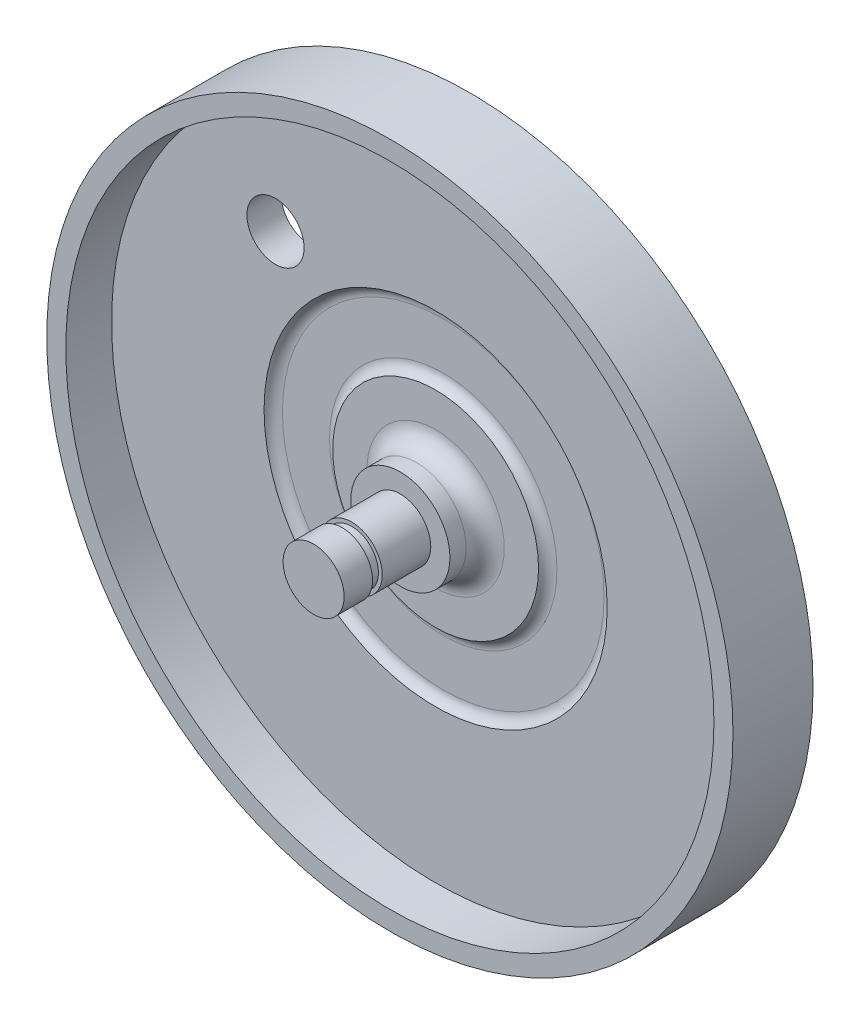
ISO-10303-21;
HEADER;
FILE_DESCRIPTION(('STEP AP214'),'2;1');
FILE_NAME('part.step','',(''),(''),'','','');
FILE_SCHEMA(('AUTOMOTIVE_DESIGN { 1 0 10303 214 1 1 1 1 }'));
ENDSEC;
DATA;
#1=APPLICATION_CONTEXT('core data for automotive mechanical design processes');
#2=APPLICATION_PROTOCOL_DEFINITION('international standard','automotive_design',2000,#1);
#3=PRODUCT_CONTEXT('',#1,'mechanical');
#4=PRODUCT('Part','Part','',(#3));
#5=PRODUCT_RELATED_PRODUCT_CATEGORY('part','',(#4));
#6=PRODUCT_DEFINITION_FORMATION('','',#4);
#7=PRODUCT_DEFINITION_CONTEXT('part definition',#1,'design');
#8=PRODUCT_DEFINITION('design','',#6,#7);
#9=PRODUCT_DEFINITION_SHAPE('','',#8);
#10=(LENGTH_UNIT() NAMED_UNIT(*) SI_UNIT(.MILLI.,.METRE.));
#11=(NAMED_UNIT(*) PLANE_ANGLE_UNIT() SI_UNIT($,.RADIAN.));
#12=(NAMED_UNIT(*) SI_UNIT($,.STERADIAN.) SOLID_ANGLE_UNIT());
#13=UNCERTAINTY_MEASURE_WITH_UNIT(LENGTH_MEASURE(1.E-05),#10,'distance_accuracy_value','');
#14=(GEOMETRIC_REPRESENTATION_CONTEXT(3) GLOBAL_UNCERTAINTY_ASSIGNED_CONTEXT((#13)) GLOBAL_UNIT_ASSIGNED_CONTEXT((#10,
#11,#12)) REPRESENTATION_CONTEXT('',''));
#15=CARTESIAN_POINT('',(0.,0.,0.));
#16=DIRECTION('',(0.,0.,1.));
#17=DIRECTION('',(1.,0.,0.));
#18=AXIS2_PLACEMENT_3D('',#15,#16,#17);
#19=CARTESIAN_POINT('',(0.,0.,2.5));
#20=DIRECTION('',(0.,0.,1.));
#21=DIRECTION('',(1.,0.,0.));
#22=AXIS2_PLACEMENT_3D('',#19,#20,#21);
#23=PLANE('',#22);
#24=CARTESIAN_POINT('',(0.,0.,2.5));
#25=DIRECTION('',(0.,0.,1.));
#26=DIRECTION('',(1.,0.,0.));
#27=AXIS2_PLACEMENT_3D('',#24,#25,#26);
#28=CIRCLE('',#27,9.);
#29=CARTESIAN_POINT('',(9.,0.,2.5));
#30=VERTEX_POINT('',#29);
#31=EDGE_CURVE('E12',#30,#30,#28,.F.);
#32=ORIENTED_EDGE('',*,*,#31,.T.);
#33=EDGE_LOOP('',(#32));
#34=FACE_BOUND('',#33,.T.);
#35=CARTESIAN_POINT('',(0.,0.,2.5));
#36=DIRECTION('',(0.,0.,1.));
#37=DIRECTION('',(1.,0.,0.));
#38=AXIS2_PLACEMENT_3D('',#35,#36,#37);
#39=CIRCLE('',#38,13.5);
#40=CARTESIAN_POINT('',(13.5,0.,2.5));
#41=VERTEX_POINT('',#40);
#42=EDGE_CURVE('E205',#41,#41,#39,.T.);
#43=ORIENTED_EDGE('',*,*,#42,.T.);
#44=EDGE_LOOP('',(#43));
#45=FACE_BOUND('',#44,.T.);
#46=ADVANCED_FACE('F56',(#34,#45),#23,.T.);
#47=CARTESIAN_POINT('',(0.,0.,1.5));
#48=DIRECTION('',(0.,0.,1.));
#49=DIRECTION('',(1.,0.,0.));
#50=AXIS2_PLACEMENT_3D('',#47,#48,#49);
#51=PLANE('',#50);
#52=CARTESIAN_POINT('',(0.,0.,1.5));
#53=DIRECTION('',(0.,0.,1.));
#54=DIRECTION('',(1.,0.,0.));
#55=AXIS2_PLACEMENT_3D('',#52,#53,#54);
#56=CIRCLE('',#55,21.0857864376269);
#57=CARTESIAN_POINT('',(21.0857864376269,0.,1.5));
#58=VERTEX_POINT('',#57);
#59=EDGE_CURVE('E199',#58,#58,#56,.T.);
#60=ORIENTED_EDGE('',*,*,#59,.T.);
#61=EDGE_LOOP('',(#60));
#62=FACE_BOUND('',#61,.T.);
#63=CARTESIAN_POINT('',(0.,0.,1.5));
#64=DIRECTION('',(0.,0.,1.));
#65=DIRECTION('',(1.,0.,0.));
#66=AXIS2_PLACEMENT_3D('',#63,#64,#65);
#67=CIRCLE('',#66,14.9142135623731);
#68=CARTESIAN_POINT('',(14.9142135623731,0.,1.5));
#69=VERTEX_POINT('',#68);
#70=EDGE_CURVE('E196',#69,#69,#67,.F.);
#71=ORIENTED_EDGE('',*,*,#70,.T.);
#72=EDGE_LOOP('',(#71));
#73=FACE_BOUND('',#72,.T.);
#74=ADVANCED_FACE('F224',(#62,#73),#51,.T.);
#75=CARTESIAN_POINT('',(0.,0.,0.));
#76=DIRECTION('',(0.,0.,-1.));
#77=DIRECTION('',(-1.,0.,0.));
#78=AXIS2_PLACEMENT_3D('',#75,#76,#77);
#79=PLANE('',#78);
#80=DIRECTION('',(0.5,0.866025403784439,0.));
#81=VECTOR('',#80,1.);
#82=CARTESIAN_POINT('',(-6.6395280956807,0.,0.));
#83=LINE('',#82,#81);
#84=CARTESIAN_POINT('',(-6.6395280956807,0.,0.));
#85=VERTEX_POINT('',#84);
#86=CARTESIAN_POINT('',(-3.31976404784035,5.75,0.));
#87=VERTEX_POINT('',#86);
#88=EDGE_CURVE('E105',#85,#87,#83,.T.);
#89=ORIENTED_EDGE('',*,*,#88,.T.);
#90=DIRECTION('',(1.,0.,0.));
#91=VECTOR('',#90,1.);
#92=CARTESIAN_POINT('',(-3.31976404784035,5.75,0.));
#93=LINE('',#92,#91);
#94=CARTESIAN_POINT('',(3.31976404784035,5.75,0.));
#95=VERTEX_POINT('',#94);
#96=EDGE_CURVE('E317',#87,#95,#93,.T.);
#97=ORIENTED_EDGE('',*,*,#96,.T.);
#98=DIRECTION('',(0.5,-0.866025403784439,0.));
#99=VECTOR('',#98,1.);
#100=CARTESIAN_POINT('',(3.31976404784035,5.75,0.));
#101=LINE('',#100,#99);
#102=CARTESIAN_POINT('',(6.63952809568069,0.,0.));
#103=VERTEX_POINT('',#102);
#104=EDGE_CURVE('E119',#95,#103,#101,.T.);
#105=ORIENTED_EDGE('',*,*,#104,.T.);
#106=DIRECTION('',(-0.5,-0.866025403784439,0.));
#107=VECTOR('',#106,1.);
#108=CARTESIAN_POINT('',(6.63952809568069,0.,0.));
#109=LINE('',#108,#107);
#110=CARTESIAN_POINT('',(3.31976404784035,-5.75,0.));
#111=VERTEX_POINT('',#110);
#112=EDGE_CURVE('E112',#103,#111,#109,.T.);
#113=ORIENTED_EDGE('',*,*,#112,.T.);
#114=DIRECTION('',(-1.,0.,0.));
#115=VECTOR('',#114,1.);
#116=CARTESIAN_POINT('',(3.31976404784035,-5.75,0.));
#117=LINE('',#116,#115);
#118=CARTESIAN_POINT('',(-3.31976404784035,-5.75,0.));
#119=VERTEX_POINT('',#118);
#120=EDGE_CURVE('E116',#111,#119,#117,.T.);
#121=ORIENTED_EDGE('',*,*,#120,.T.);
#122=DIRECTION('',(-0.5,0.866025403784439,0.));
#123=VECTOR('',#122,1.);
#124=CARTESIAN_POINT('',(-3.31976404784035,-5.75,0.));
#125=LINE('',#124,#123);
#126=EDGE_CURVE('E80',#119,#85,#125,.T.);
#127=ORIENTED_EDGE('',*,*,#126,.T.);
#128=EDGE_LOOP('',(#89,#97,#105,#113,#121,#127));
#129=FACE_BOUND('',#128,.T.);
#130=ADVANCED_FACE('F114',(#129),#79,.T.);
#131=CARTESIAN_POINT('',(0.,0.,-2.));
#132=DIRECTION('',(0.,0.,1.));
#133=DIRECTION('',(1.,0.,0.));
#134=AXIS2_PLACEMENT_3D('',#131,#132,#133);
#135=CYLINDRICAL_SURFACE('',#134,45.);
#136=CARTESIAN_POINT('',(0.,0.,-2.));
#137=DIRECTION('',(0.,0.,1.));
#138=DIRECTION('',(1.,0.,0.));
#139=AXIS2_PLACEMENT_3D('',#136,#137,#138);
#140=CIRCLE('',#139,45.);
#141=CARTESIAN_POINT('',(45.,0.,-2.));
#142=VERTEX_POINT('',#141);
#143=EDGE_CURVE('E188',#142,#142,#140,.T.);
#144=ORIENTED_EDGE('',*,*,#143,.T.);
#145=EDGE_LOOP('',(#144));
#146=FACE_BOUND('',#145,.T.);
#147=CARTESIAN_POINT('',(0.,0.,8.5));
#148=DIRECTION('',(0.,0.,1.));
#149=DIRECTION('',(1.,0.,0.));
#150=AXIS2_PLACEMENT_3D('',#147,#148,#149);
#151=CIRCLE('',#150,45.);
#152=CARTESIAN_POINT('',(45.,0.,8.5));
#153=VERTEX_POINT('',#152);
#154=EDGE_CURVE('E184',#153,#153,#151,.T.);
#155=ORIENTED_EDGE('',*,*,#154,.F.);
#156=EDGE_LOOP('',(#155));
#157=FACE_BOUND('',#156,.T.);
#158=ADVANCED_FACE('F285',(#146,#157),#135,.T.);
#159=CARTESIAN_POINT('',(3.31976404784035,5.75,0.));
#160=DIRECTION('',(0.866025403784439,0.5,0.));
#161=DIRECTION('',(-0.5,0.866025403784439,0.));
#162=AXIS2_PLACEMENT_3D('',#159,#160,#161);
#163=PLANE('',#162);
#164=DIRECTION('',(0.5,-0.866025403784439,0.));
#165=VECTOR('',#164,1.);
#166=CARTESIAN_POINT('',(3.31976404784035,5.75,-2.));
#167=LINE('',#166,#165);
#168=CARTESIAN_POINT('',(3.31976404784035,5.75,-2.));
#169=VERTEX_POINT('',#168);
#170=CARTESIAN_POINT('',(6.63952809568069,0.,-2.));
#171=VERTEX_POINT('',#170);
#172=EDGE_CURVE('E145',#169,#171,#167,.T.);
#173=ORIENTED_EDGE('',*,*,#172,.T.);
#174=DIRECTION('',(0.,0.,-1.));
#175=VECTOR('',#174,1.);
#176=CARTESIAN_POINT('',(6.63952809568069,0.,0.));
#177=LINE('',#176,#175);
#178=EDGE_CURVE('E132',#103,#171,#177,.T.);
#179=ORIENTED_EDGE('',*,*,#178,.F.);
#180=ORIENTED_EDGE('',*,*,#104,.F.);
#181=DIRECTION('',(0.,0.,-1.));
#182=VECTOR('',#181,1.);
#183=CARTESIAN_POINT('',(3.31976404784035,5.75,0.));
#184=LINE('',#183,#182);
#185=EDGE_CURVE('E157',#95,#169,#184,.T.);
#186=ORIENTED_EDGE('',*,*,#185,.T.);
#187=EDGE_LOOP('',(#173,#179,#180,#186));
#188=FACE_BOUND('',#187,.T.);
#189=ADVANCED_FACE('F287',(#188),#163,.F.);
#190=CARTESIAN_POINT('',(6.63952809568069,0.,0.));
#191=DIRECTION('',(0.866025403784439,-0.5,0.));
#192=DIRECTION('',(0.5,0.866025403784439,0.));
#193=AXIS2_PLACEMENT_3D('',#190,#191,#192);
#194=PLANE('',#193);
#195=DIRECTION('',(-0.5,-0.866025403784439,0.));
#196=VECTOR('',#195,1.);
#197=CARTESIAN_POINT('',(6.63952809568069,0.,-2.));
#198=LINE('',#197,#196);
#199=CARTESIAN_POINT('',(3.31976404784035,-5.75,-2.));
#200=VERTEX_POINT('',#199);
#201=EDGE_CURVE('E127',#171,#200,#198,.T.);
#202=ORIENTED_EDGE('',*,*,#201,.T.);
#203=DIRECTION('',(0.,0.,-1.));
#204=VECTOR('',#203,1.);
#205=CARTESIAN_POINT('',(3.31976404784035,-5.75,0.));
#206=LINE('',#205,#204);
#207=EDGE_CURVE('E124',#111,#200,#206,.T.);
#208=ORIENTED_EDGE('',*,*,#207,.F.);
#209=ORIENTED_EDGE('',*,*,#112,.F.);
#210=ORIENTED_EDGE('',*,*,#178,.T.);
#211=EDGE_LOOP('',(#202,#208,#209,#210));
#212=FACE_BOUND('',#211,.T.);
#213=ADVANCED_FACE('F125',(#212),#194,.F.);
#214=CARTESIAN_POINT('',(3.31976404784035,-5.75,0.));
#215=DIRECTION('',(0.,-1.,0.));
#216=DIRECTION('',(1.,0.,0.));
#217=AXIS2_PLACEMENT_3D('',#214,#215,#216);
#218=PLANE('',#217);
#219=DIRECTION('',(-1.,0.,0.));
#220=VECTOR('',#219,1.);
#221=CARTESIAN_POINT('',(3.31976404784035,-5.75,-2.));
#222=LINE('',#221,#220);
#223=CARTESIAN_POINT('',(-3.31976404784035,-5.75,-2.));
#224=VERTEX_POINT('',#223);
#225=EDGE_CURVE('E149',#200,#224,#222,.T.);
#226=ORIENTED_EDGE('',*,*,#225,.T.);
#227=DIRECTION('',(0.,0.,-1.));
#228=VECTOR('',#227,1.);
#229=CARTESIAN_POINT('',(-3.31976404784035,-5.75,0.));
#230=LINE('',#229,#228);
#231=EDGE_CURVE('E131',#119,#224,#230,.T.);
#232=ORIENTED_EDGE('',*,*,#231,.F.);
#233=ORIENTED_EDGE('',*,*,#120,.F.);
#234=ORIENTED_EDGE('',*,*,#207,.T.);
#235=EDGE_LOOP('',(#226,#232,#233,#234));
#236=FACE_BOUND('',#235,.T.);
#237=ADVANCED_FACE('F134',(#236),#218,.F.);
#238=CARTESIAN_POINT('',(-3.31976404784035,-5.75,0.));
#239=DIRECTION('',(-0.866025403784439,-0.5,0.));
#240=DIRECTION('',(0.5,-0.866025403784439,0.));
#241=AXIS2_PLACEMENT_3D('',#238,#239,#240);
#242=PLANE('',#241);
#243=DIRECTION('',(-0.5,0.866025403784439,0.));
#244=VECTOR('',#243,1.);
#245=CARTESIAN_POINT('',(-3.31976404784035,-5.75,-2.));
#246=LINE('',#245,#244);
#247=CARTESIAN_POINT('',(-6.6395280956807,0.,-2.));
#248=VERTEX_POINT('',#247);
#249=EDGE_CURVE('E151',#224,#248,#246,.T.);
#250=ORIENTED_EDGE('',*,*,#249,.T.);
#251=DIRECTION('',(0.,0.,-1.));
#252=VECTOR('',#251,1.);
#253=CARTESIAN_POINT('',(-6.6395280956807,0.,0.));
#254=LINE('',#253,#252);
#255=EDGE_CURVE('E100',#85,#248,#254,.T.);
#256=ORIENTED_EDGE('',*,*,#255,.F.);
#257=ORIENTED_EDGE('',*,*,#126,.F.);
#258=ORIENTED_EDGE('',*,*,#231,.T.);
#259=EDGE_LOOP('',(#250,#256,#257,#258));
#260=FACE_BOUND('',#259,.T.);
#261=ADVANCED_FACE('F326',(#260),#242,.F.);
#262=CARTESIAN_POINT('',(-6.6395280956807,0.,0.));
#263=DIRECTION('',(-0.866025403784439,0.5,0.));
#264=DIRECTION('',(-0.5,-0.866025403784439,0.));
#265=AXIS2_PLACEMENT_3D('',#262,#263,#264);
#266=PLANE('',#265);
#267=DIRECTION('',(0.5,0.866025403784439,0.));
#268=VECTOR('',#267,1.);
#269=CARTESIAN_POINT('',(-6.6395280956807,0.,-2.));
#270=LINE('',#269,#268);
#271=CARTESIAN_POINT('',(-3.31976404784035,5.75,-2.));
#272=VERTEX_POINT('',#271);
#273=EDGE_CURVE('E71',#248,#272,#270,.T.);
#274=ORIENTED_EDGE('',*,*,#273,.T.);
#275=DIRECTION('',(0.,0.,-1.));
#276=VECTOR('',#275,1.);
#277=CARTESIAN_POINT('',(-3.31976404784035,5.75,0.));
#278=LINE('',#277,#276);
#279=EDGE_CURVE('E136',#87,#272,#278,.T.);
#280=ORIENTED_EDGE('',*,*,#279,.F.);
#281=ORIENTED_EDGE('',*,*,#88,.F.);
#282=ORIENTED_EDGE('',*,*,#255,.T.);
#283=EDGE_LOOP('',(#274,#280,#281,#282));
#284=FACE_BOUND('',#283,.T.);
#285=ADVANCED_FACE('F278',(#284),#266,.F.);
#286=CARTESIAN_POINT('',(-3.31976404784035,5.75,0.));
#287=DIRECTION('',(0.,1.,0.));
#288=DIRECTION('',(-1.,0.,0.));
#289=AXIS2_PLACEMENT_3D('',#286,#287,#288);
#290=PLANE('',#289);
#291=DIRECTION('',(1.,0.,0.));
#292=VECTOR('',#291,1.);
#293=CARTESIAN_POINT('',(-3.31976404784035,5.75,-2.));
#294=LINE('',#293,#292);
#295=EDGE_CURVE('E141',#272,#169,#294,.T.);
#296=ORIENTED_EDGE('',*,*,#295,.T.);
#297=ORIENTED_EDGE('',*,*,#185,.F.);
#298=ORIENTED_EDGE('',*,*,#96,.F.);
#299=ORIENTED_EDGE('',*,*,#279,.T.);
#300=EDGE_LOOP('',(#296,#297,#298,#299));
#301=FACE_BOUND('',#300,.T.);
#302=ADVANCED_FACE('F273',(#301),#290,.F.);
#303=CARTESIAN_POINT('',(0.,0.,8.5));
#304=DIRECTION('',(0.,0.,1.));
#305=DIRECTION('',(1.,0.,0.));
#306=AXIS2_PLACEMENT_3D('',#303,#304,#305);
#307=PLANE('',#306);
#308=ORIENTED_EDGE('',*,*,#154,.T.);
#309=EDGE_LOOP('',(#308));
#310=FACE_BOUND('',#309,.T.);
#311=CARTESIAN_POINT('',(0.,0.,8.5));
#312=DIRECTION('',(0.,0.,1.));
#313=DIRECTION('',(1.,0.,0.));
#314=AXIS2_PLACEMENT_3D('',#311,#312,#313);
#315=CIRCLE('',#314,42.5);
#316=CARTESIAN_POINT('',(42.5,0.,8.5));
#317=VERTEX_POINT('',#316);
#318=EDGE_CURVE('E180',#317,#317,#315,.T.);
#319=ORIENTED_EDGE('',*,*,#318,.F.);
#320=EDGE_LOOP('',(#319));
#321=FACE_BOUND('',#320,.T.);
#322=ADVANCED_FACE('F267',(#310,#321),#307,.T.);
#323=CARTESIAN_POINT('',(0.,0.,-2.));
#324=DIRECTION('',(0.,0.,1.));
#325=DIRECTION('',(1.,0.,0.));
#326=AXIS2_PLACEMENT_3D('',#323,#324,#325);
#327=PLANE('',#326);
#328=CARTESIAN_POINT('',(-21.,21.,-2.));
#329=DIRECTION('',(0.,0.,1.));
#330=DIRECTION('',(1.,0.,0.));
#331=AXIS2_PLACEMENT_3D('',#328,#329,#330);
#332=CIRCLE('',#331,3.75);
#333=CARTESIAN_POINT('',(-17.25,21.,-2.));
#334=VERTEX_POINT('',#333);
#335=EDGE_CURVE('E142',#334,#334,#332,.T.);
#336=ORIENTED_EDGE('',*,*,#335,.T.);
#337=EDGE_LOOP('',(#336));
#338=FACE_BOUND('',#337,.T.);
#339=ORIENTED_EDGE('',*,*,#295,.F.);
#340=ORIENTED_EDGE('',*,*,#273,.F.);
#341=ORIENTED_EDGE('',*,*,#249,.F.);
#342=ORIENTED_EDGE('',*,*,#225,.F.);
#343=ORIENTED_EDGE('',*,*,#201,.F.);
#344=ORIENTED_EDGE('',*,*,#172,.F.);
#345=EDGE_LOOP('',(#339,#340,#341,#342,#343,#344));
#346=FACE_BOUND('',#345,.T.);
#347=ORIENTED_EDGE('',*,*,#143,.F.);
#348=EDGE_LOOP('',(#347));
#349=FACE_BOUND('',#348,.T.);
#350=ADVANCED_FACE('F261',(#338,#346,#349),#327,.F.);
#351=CARTESIAN_POINT('',(0.,0.,8.5));
#352=DIRECTION('',(0.,0.,-1.));
#353=DIRECTION('',(-1.,0.,0.));
#354=AXIS2_PLACEMENT_3D('',#351,#352,#353);
#355=CYLINDRICAL_SURFACE('',#354,42.5);
#356=ORIENTED_EDGE('',*,*,#318,.T.);
#357=EDGE_LOOP('',(#356));
#358=FACE_BOUND('',#357,.T.);
#359=CARTESIAN_POINT('',(0.,0.,2.5));
#360=DIRECTION('',(0.,0.,1.));
#361=DIRECTION('',(1.,0.,0.));
#362=AXIS2_PLACEMENT_3D('',#359,#360,#361);
#363=CIRCLE('',#362,42.5);
#364=CARTESIAN_POINT('',(42.5,0.,2.5));
#365=VERTEX_POINT('',#364);
#366=EDGE_CURVE('E192',#365,#365,#363,.F.);
#367=ORIENTED_EDGE('',*,*,#366,.T.);
#368=EDGE_LOOP('',(#367));
#369=FACE_BOUND('',#368,.T.);
#370=ADVANCED_FACE('F247',(#358,#369),#355,.F.);
#371=CARTESIAN_POINT('',(-21.,21.,-2.));
#372=DIRECTION('',(0.,0.,1.));
#373=DIRECTION('',(1.,0.,0.));
#374=AXIS2_PLACEMENT_3D('',#371,#372,#373);
#375=CYLINDRICAL_SURFACE('',#374,3.75);
#376=ORIENTED_EDGE('',*,*,#335,.F.);
#377=EDGE_LOOP('',(#376));
#378=FACE_BOUND('',#377,.T.);
#379=CARTESIAN_POINT('',(-21.,21.,2.5));
#380=DIRECTION('',(0.,0.,1.));
#381=DIRECTION('',(1.,0.,0.));
#382=AXIS2_PLACEMENT_3D('',#379,#380,#381);
#383=CIRCLE('',#382,3.75);
#384=CARTESIAN_POINT('',(-17.25,21.,2.5));
#385=VERTEX_POINT('',#384);
#386=EDGE_CURVE('E257',#385,#385,#383,.T.);
#387=ORIENTED_EDGE('',*,*,#386,.T.);
#388=EDGE_LOOP('',(#387));
#389=FACE_BOUND('',#388,.T.);
#390=ADVANCED_FACE('F238',(#378,#389),#375,.F.);
#391=CARTESIAN_POINT('',(0.,0.,2.5));
#392=DIRECTION('',(0.,0.,1.));
#393=DIRECTION('',(1.,0.,0.));
#394=AXIS2_PLACEMENT_3D('',#391,#392,#393);
#395=CIRCLE('',#394,22.5);
#396=CARTESIAN_POINT('',(22.5,0.,2.5));
#397=VERTEX_POINT('',#396);
#398=EDGE_CURVE('E253',#397,#397,#395,.T.);
#399=ORIENTED_EDGE('',*,*,#398,.F.);
#400=EDGE_LOOP('',(#399));
#401=FACE_BOUND('',#400,.T.);
#402=ORIENTED_EDGE('',*,*,#386,.F.);
#403=EDGE_LOOP('',(#402));
#404=FACE_BOUND('',#403,.T.);
#405=ORIENTED_EDGE('',*,*,#366,.F.);
#406=EDGE_LOOP('',(#405));
#407=FACE_BOUND('',#406,.T.);
#408=ADVANCED_FACE('F227',(#401,#404,#407),#23,.T.);
#409=CARTESIAN_POINT('',(0.,0.,3.));
#410=DIRECTION('',(0.,0.,-1.));
#411=DIRECTION('',(-1.,0.,0.));
#412=AXIS2_PLACEMENT_3D('',#409,#410,#411);
#413=TOROIDAL_SURFACE('',#412,21.0857864376269,1.5);
#414=ORIENTED_EDGE('',*,*,#398,.T.);
#415=EDGE_LOOP('',(#414));
#416=FACE_BOUND('',#415,.T.);
#417=ORIENTED_EDGE('',*,*,#59,.F.);
#418=EDGE_LOOP('',(#417));
#419=FACE_BOUND('',#418,.T.);
#420=ADVANCED_FACE('F237',(#416,#419),#413,.F.);
#421=CARTESIAN_POINT('',(0.,0.,3.));
#422=DIRECTION('',(0.,0.,1.));
#423=DIRECTION('',(1.,0.,0.));
#424=AXIS2_PLACEMENT_3D('',#421,#422,#423);
#425=TOROIDAL_SURFACE('',#424,14.9142135623731,1.5);
#426=ORIENTED_EDGE('',*,*,#70,.F.);
#427=EDGE_LOOP('',(#426));
#428=FACE_BOUND('',#427,.T.);
#429=ORIENTED_EDGE('',*,*,#42,.F.);
#430=EDGE_LOOP('',(#429));
#431=FACE_BOUND('',#430,.T.);
#432=ADVANCED_FACE('F244',(#428,#431),#425,.F.);
#433=CARTESIAN_POINT('',(0.,0.,7.127));
#434=DIRECTION('',(0.,0.,-1.));
#435=DIRECTION('',(-1.,0.,0.));
#436=AXIS2_PLACEMENT_3D('',#433,#434,#435);
#437=CYLINDRICAL_SURFACE('',#436,6.5);
#438=CARTESIAN_POINT('',(0.,0.,5.));
#439=DIRECTION('',(0.,0.,1.));
#440=DIRECTION('',(1.,0.,0.));
#441=AXIS2_PLACEMENT_3D('',#438,#439,#440);
#442=CIRCLE('',#441,6.5);
#443=CARTESIAN_POINT('',(6.5,0.,5.));
#444=VERTEX_POINT('',#443);
#445=EDGE_CURVE('E64',#444,#444,#442,.T.);
#446=ORIENTED_EDGE('',*,*,#445,.T.);
#447=EDGE_LOOP('',(#446));
#448=FACE_BOUND('',#447,.T.);
#449=CARTESIAN_POINT('',(0.,0.,7.127));
#450=DIRECTION('',(0.,0.,-1.));
#451=DIRECTION('',(-1.,0.,0.));
#452=AXIS2_PLACEMENT_3D('',#449,#450,#451);
#453=CIRCLE('',#452,6.5);
#454=CARTESIAN_POINT('',(-6.5,0.,7.127));
#455=VERTEX_POINT('',#454);
#456=EDGE_CURVE('E206',#455,#455,#453,.T.);
#457=ORIENTED_EDGE('',*,*,#456,.T.);
#458=EDGE_LOOP('',(#457));
#459=FACE_BOUND('',#458,.T.);
#460=ADVANCED_FACE('F210',(#448,#459),#437,.T.);
#461=CARTESIAN_POINT('',(0.,0.,7.127));
#462=DIRECTION('',(0.,0.,-1.));
#463=DIRECTION('',(-1.,0.,0.));
#464=AXIS2_PLACEMENT_3D('',#461,#462,#463);
#465=PLANE('',#464);
#466=CARTESIAN_POINT('',(0.,0.,7.127));
#467=DIRECTION('',(0.,0.,-1.));
#468=DIRECTION('',(-1.,0.,0.));
#469=AXIS2_PLACEMENT_3D('',#466,#467,#468);
#470=CIRCLE('',#469,3.5);
#471=CARTESIAN_POINT('',(-3.5,0.,7.127));
#472=VERTEX_POINT('',#471);
#473=EDGE_CURVE('E203',#472,#472,#470,.F.);
#474=ORIENTED_EDGE('',*,*,#473,.F.);
#475=EDGE_LOOP('',(#474));
#476=FACE_BOUND('',#475,.T.);
#477=ORIENTED_EDGE('',*,*,#456,.F.);
#478=EDGE_LOOP('',(#477));
#479=FACE_BOUND('',#478,.T.);
#480=ADVANCED_FACE('F302',(#476,#479),#465,.F.);
#481=CARTESIAN_POINT('',(0.,0.,18.5));
#482=DIRECTION('',(0.,0.,1.));
#483=DIRECTION('',(1.,0.,0.));
#484=AXIS2_PLACEMENT_3D('',#481,#482,#483);
#485=PLANE('',#484);
#486=CARTESIAN_POINT('',(0.,0.,18.5));
#487=DIRECTION('',(0.,0.,1.));
#488=DIRECTION('',(1.,0.,0.));
#489=AXIS2_PLACEMENT_3D('',#486,#487,#488);
#490=CIRCLE('',#489,4.);
#491=CARTESIAN_POINT('',(4.,0.,18.5));
#492=VERTEX_POINT('',#491);
#493=EDGE_CURVE('E175',#492,#492,#490,.T.);
#494=ORIENTED_EDGE('',*,*,#493,.T.);
#495=EDGE_LOOP('',(#494));
#496=FACE_BOUND('',#495,.T.);
#497=ADVANCED_FACE('F349',(#496),#485,.T.);
#498=CARTESIAN_POINT('',(0.,0.,18.5));
#499=DIRECTION('',(0.,0.,-1.));
#500=DIRECTION('',(-1.,0.,0.));
#501=AXIS2_PLACEMENT_3D('',#498,#499,#500);
#502=CYLINDRICAL_SURFACE('',#501,4.);
#503=CARTESIAN_POINT('',(0.,0.,14.77));
#504=DIRECTION('',(0.,0.,1.));
#505=DIRECTION('',(1.,0.,0.));
#506=AXIS2_PLACEMENT_3D('',#503,#504,#505);
#507=CIRCLE('',#506,4.);
#508=CARTESIAN_POINT('',(4.,0.,14.77));
#509=VERTEX_POINT('',#508);
#510=EDGE_CURVE('E172',#509,#509,#507,.T.);
#511=ORIENTED_EDGE('',*,*,#510,.T.);
#512=EDGE_LOOP('',(#511));
#513=FACE_BOUND('',#512,.T.);
#514=ORIENTED_EDGE('',*,*,#493,.F.);
#515=EDGE_LOOP('',(#514));
#516=FACE_BOUND('',#515,.T.);
#517=ADVANCED_FACE('F270',(#513,#516),#502,.T.);
#518=CARTESIAN_POINT('',(0.,0.,14.77));
#519=DIRECTION('',(0.,0.,1.));
#520=DIRECTION('',(1.,0.,0.));
#521=AXIS2_PLACEMENT_3D('',#518,#519,#520);
#522=PLANE('',#521);
#523=ORIENTED_EDGE('',*,*,#510,.F.);
#524=EDGE_LOOP('',(#523));
#525=FACE_BOUND('',#524,.T.);
#526=CARTESIAN_POINT('',(0.,0.,14.77));
#527=DIRECTION('',(0.,0.,1.));
#528=DIRECTION('',(1.,0.,0.));
#529=AXIS2_PLACEMENT_3D('',#526,#527,#528);
#530=CIRCLE('',#529,3.5);
#531=CARTESIAN_POINT('',(3.5,0.,14.77));
#532=VERTEX_POINT('',#531);
#533=EDGE_CURVE('E166',#532,#532,#530,.T.);
#534=ORIENTED_EDGE('',*,*,#533,.T.);
#535=EDGE_LOOP('',(#534));
#536=FACE_BOUND('',#535,.T.);
#537=ADVANCED_FACE('F342',(#525,#536),#522,.F.);
#538=CARTESIAN_POINT('',(0.,0.,14.77));
#539=DIRECTION('',(0.,0.,-1.));
#540=DIRECTION('',(-1.,0.,0.));
#541=AXIS2_PLACEMENT_3D('',#538,#539,#540);
#542=CYLINDRICAL_SURFACE('',#541,3.5);
#543=ORIENTED_EDGE('',*,*,#533,.F.);
#544=EDGE_LOOP('',(#543));
#545=FACE_BOUND('',#544,.T.);
#546=CARTESIAN_POINT('',(0.,0.,13.5));
#547=DIRECTION('',(0.,0.,1.));
#548=DIRECTION('',(1.,0.,0.));
#549=AXIS2_PLACEMENT_3D('',#546,#547,#548);
#550=CIRCLE('',#549,3.5);
#551=CARTESIAN_POINT('',(3.5,0.,13.5));
#552=VERTEX_POINT('',#551);
#553=EDGE_CURVE('E165',#552,#552,#550,.T.);
#554=ORIENTED_EDGE('',*,*,#553,.T.);
#555=EDGE_LOOP('',(#554));
#556=FACE_BOUND('',#555,.T.);
#557=ADVANCED_FACE('F338',(#545,#556),#542,.T.);
#558=CARTESIAN_POINT('',(0.,0.,13.5));
#559=DIRECTION('',(0.,0.,1.));
#560=DIRECTION('',(1.,0.,0.));
#561=AXIS2_PLACEMENT_3D('',#558,#559,#560);
#562=PLANE('',#561);
#563=CARTESIAN_POINT('',(0.,0.,13.5));
#564=DIRECTION('',(0.,0.,1.));
#565=DIRECTION('',(1.,0.,0.));
#566=AXIS2_PLACEMENT_3D('',#563,#564,#565);
#567=CIRCLE('',#566,4.);
#568=CARTESIAN_POINT('',(4.,0.,13.5));
#569=VERTEX_POINT('',#568);
#570=EDGE_CURVE('E169',#569,#569,#567,.T.);
#571=ORIENTED_EDGE('',*,*,#570,.T.);
#572=EDGE_LOOP('',(#571));
#573=FACE_BOUND('',#572,.T.);
#574=ORIENTED_EDGE('',*,*,#553,.F.);
#575=EDGE_LOOP('',(#574));
#576=FACE_BOUND('',#575,.T.);
#577=ADVANCED_FACE('F341',(#573,#576),#562,.T.);
#578=CARTESIAN_POINT('',(0.,0.,7.135));
#579=DIRECTION('',(0.,0.,1.));
#580=DIRECTION('',(1.,0.,0.));
#581=AXIS2_PLACEMENT_3D('',#578,#579,#580);
#582=CIRCLE('',#581,4.);
#583=CARTESIAN_POINT('',(4.,0.,7.135));
#584=VERTEX_POINT('',#583);
#585=EDGE_CURVE('E162',#584,#584,#582,.T.);
#586=ORIENTED_EDGE('',*,*,#585,.T.);
#587=EDGE_LOOP('',(#586));
#588=FACE_BOUND('',#587,.T.);
#589=ORIENTED_EDGE('',*,*,#570,.F.);
#590=EDGE_LOOP('',(#589));
#591=FACE_BOUND('',#590,.T.);
#592=ADVANCED_FACE('F336',(#588,#591),#502,.T.);
#593=CARTESIAN_POINT('',(0.,0.,7.135));
#594=DIRECTION('',(0.,0.,1.));
#595=DIRECTION('',(1.,0.,0.));
#596=AXIS2_PLACEMENT_3D('',#593,#594,#595);
#597=PLANE('',#596);
#598=CARTESIAN_POINT('',(0.,0.,7.135));
#599=DIRECTION('',(0.,0.,1.));
#600=DIRECTION('',(1.,0.,0.));
#601=AXIS2_PLACEMENT_3D('',#598,#599,#600);
#602=CIRCLE('',#601,3.5);
#603=CARTESIAN_POINT('',(3.5,0.,7.135));
#604=VERTEX_POINT('',#603);
#605=EDGE_CURVE('E154',#604,#604,#602,.T.);
#606=ORIENTED_EDGE('',*,*,#605,.T.);
#607=EDGE_LOOP('',(#606));
#608=FACE_BOUND('',#607,.T.);
#609=ORIENTED_EDGE('',*,*,#585,.F.);
#610=EDGE_LOOP('',(#609));
#611=FACE_BOUND('',#610,.T.);
#612=ADVANCED_FACE('F219',(#608,#611),#597,.F.);
#613=CARTESIAN_POINT('',(0.,0.,5.865));
#614=DIRECTION('',(0.,0.,1.));
#615=DIRECTION('',(1.,0.,0.));
#616=AXIS2_PLACEMENT_3D('',#613,#614,#615);
#617=CYLINDRICAL_SURFACE('',#616,3.5);
#618=ORIENTED_EDGE('',*,*,#605,.F.);
#619=EDGE_LOOP('',(#618));
#620=FACE_BOUND('',#619,.T.);
#621=ORIENTED_EDGE('',*,*,#473,.T.);
#622=EDGE_LOOP('',(#621));
#623=FACE_BOUND('',#622,.T.);
#624=ADVANCED_FACE('F214',(#620,#623),#617,.T.);
#625=CARTESIAN_POINT('',(0.,0.,5.));
#626=DIRECTION('',(0.,0.,1.));
#627=DIRECTION('',(1.,0.,0.));
#628=AXIS2_PLACEMENT_3D('',#625,#626,#627);
#629=TOROIDAL_SURFACE('',#628,9.,2.5);
#630=ORIENTED_EDGE('',*,*,#31,.F.);
#631=EDGE_LOOP('',(#630));
#632=FACE_BOUND('',#631,.T.);
#633=ORIENTED_EDGE('',*,*,#445,.F.);
#634=EDGE_LOOP('',(#633));
#635=FACE_BOUND('',#634,.T.);
#636=ADVANCED_FACE('F58',(#632,#635),#629,.F.);
#637=CLOSED_SHELL('',(#46,#74,#130,#158,#189,#213,#237,#261,#285,#302,#322,#350,#370,#390,#408,
#420,#432,#460,#480,#497,#517,#537,#557,#577,#592,#612,#624,#636));
#638=MANIFOLD_SOLID_BREP('B2',#637);
#639=ADVANCED_BREP_SHAPE_REPRESENTATION('',(#18,#638),#14);
#640=SHAPE_DEFINITION_REPRESENTATION(#9,#639);
ENDSEC;
END-ISO-10303-21;
